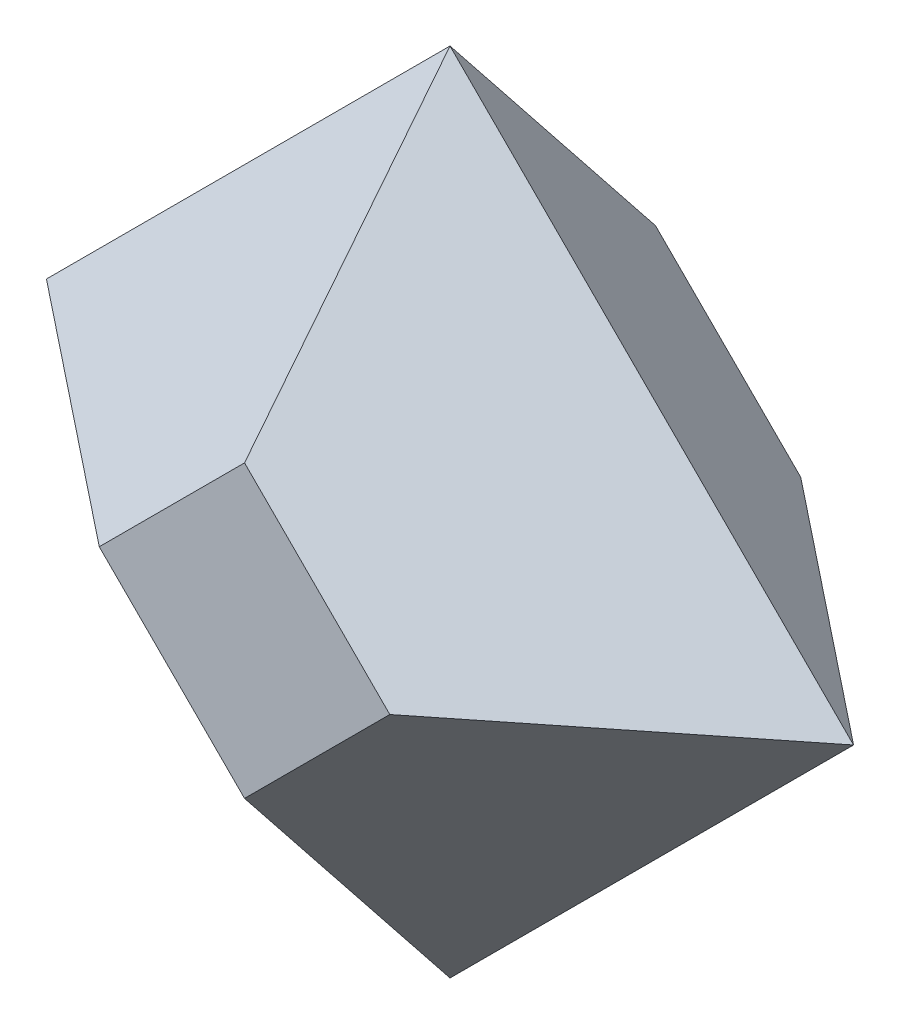
ISO-10303-21;
HEADER;
FILE_DESCRIPTION(('STEP AP214'),'2;1');
FILE_NAME('part.step','',(''),(''),'','','');
FILE_SCHEMA(('AUTOMOTIVE_DESIGN { 1 0 10303 214 1 1 1 1 }'));
ENDSEC;
DATA;
#1=APPLICATION_CONTEXT('core data for automotive mechanical design processes');
#2=APPLICATION_PROTOCOL_DEFINITION('international standard','automotive_design',2000,#1);
#3=PRODUCT_CONTEXT('',#1,'mechanical');
#4=PRODUCT('Part','Part','',(#3));
#5=PRODUCT_RELATED_PRODUCT_CATEGORY('part','',(#4));
#6=PRODUCT_DEFINITION_FORMATION('','',#4);
#7=PRODUCT_DEFINITION_CONTEXT('part definition',#1,'design');
#8=PRODUCT_DEFINITION('design','',#6,#7);
#9=PRODUCT_DEFINITION_SHAPE('','',#8);
#10=(LENGTH_UNIT() NAMED_UNIT(*) SI_UNIT(.MILLI.,.METRE.));
#11=(NAMED_UNIT(*) PLANE_ANGLE_UNIT() SI_UNIT($,.RADIAN.));
#12=(NAMED_UNIT(*) SI_UNIT($,.STERADIAN.) SOLID_ANGLE_UNIT());
#13=UNCERTAINTY_MEASURE_WITH_UNIT(LENGTH_MEASURE(1.E-05),#10,'distance_accuracy_value','');
#14=(GEOMETRIC_REPRESENTATION_CONTEXT(3) GLOBAL_UNCERTAINTY_ASSIGNED_CONTEXT((#13)) GLOBAL_UNIT_ASSIGNED_CONTEXT((#10,
#11,#12)) REPRESENTATION_CONTEXT('',''));
#15=CARTESIAN_POINT('',(0.,0.,0.));
#16=DIRECTION('',(0.,0.,1.));
#17=DIRECTION('',(1.,0.,0.));
#18=AXIS2_PLACEMENT_3D('',#15,#16,#17);
#19=CARTESIAN_POINT('',(0.,0.,9.));
#20=DIRECTION('',(0.,0.,1.));
#21=DIRECTION('',(1.,0.,0.));
#22=AXIS2_PLACEMENT_3D('',#19,#20,#21);
#23=PLANE('',#22);
#24=DIRECTION('',(-0.707106781186548,0.707106781186548,0.));
#25=VECTOR('',#24,1.);
#26=CARTESIAN_POINT('',(6.36396103067893,0.,9.));
#27=LINE('',#26,#25);
#28=CARTESIAN_POINT('',(6.36396103067893,0.,9.));
#29=VERTEX_POINT('',#28);
#30=CARTESIAN_POINT('',(0.,6.36396103067893,9.));
#31=VERTEX_POINT('',#30);
#32=EDGE_CURVE('E143',#29,#31,#27,.T.);
#33=ORIENTED_EDGE('',*,*,#32,.T.);
#34=DIRECTION('',(-0.707106781186547,-0.707106781186548,0.));
#35=VECTOR('',#34,1.);
#36=CARTESIAN_POINT('',(0.,6.36396103067893,9.));
#37=LINE('',#36,#35);
#38=CARTESIAN_POINT('',(-6.36396103067893,0.,9.));
#39=VERTEX_POINT('',#38);
#40=EDGE_CURVE('E141',#31,#39,#37,.T.);
#41=ORIENTED_EDGE('',*,*,#40,.T.);
#42=DIRECTION('',(0.707106781186548,-0.707106781186548,0.));
#43=VECTOR('',#42,1.);
#44=CARTESIAN_POINT('',(-6.36396103067893,0.,9.));
#45=LINE('',#44,#43);
#46=CARTESIAN_POINT('',(0.,-6.36396103067893,9.));
#47=VERTEX_POINT('',#46);
#48=EDGE_CURVE('E60',#39,#47,#45,.T.);
#49=ORIENTED_EDGE('',*,*,#48,.T.);
#50=DIRECTION('',(0.707106781186547,0.707106781186548,0.));
#51=VECTOR('',#50,1.);
#52=CARTESIAN_POINT('',(0.,-6.36396103067893,9.));
#53=LINE('',#52,#51);
#54=EDGE_CURVE('E12',#47,#29,#53,.T.);
#55=ORIENTED_EDGE('',*,*,#54,.T.);
#56=EDGE_LOOP('',(#33,#41,#49,#55));
#57=FACE_BOUND('',#56,.T.);
#58=ADVANCED_FACE('F51',(#57),#23,.T.);
#59=CARTESIAN_POINT('',(-4.93755597207848,-4.93755597207848,6.20689655172414));
#60=DIRECTION('',(0.528498197563233,0.528498197563233,-0.66436383882992));
#61=DIRECTION('',(0.,0.78258558087123,0.622543017479467));
#62=AXIS2_PLACEMENT_3D('',#59,#60,#61);
#63=PLANE('',#62);
#64=DIRECTION('',(0.,0.78258558087123,0.622543017479467));
#65=VECTOR('',#64,1.);
#66=CARTESIAN_POINT('',(0.,-17.6776695296637,0.));
#67=LINE('',#66,#65);
#68=CARTESIAN_POINT('',(0.,-17.6776695296637,0.));
#69=VERTEX_POINT('',#68);
#70=EDGE_CURVE('E75',#69,#47,#67,.T.);
#71=ORIENTED_EDGE('',*,*,#70,.T.);
#72=ORIENTED_EDGE('',*,*,#48,.F.);
#73=DIRECTION('',(0.78258558087123,0.,0.622543017479467));
#74=VECTOR('',#73,1.);
#75=CARTESIAN_POINT('',(-17.6776695296637,0.,0.));
#76=LINE('',#75,#74);
#77=CARTESIAN_POINT('',(-17.6776695296637,0.,0.));
#78=VERTEX_POINT('',#77);
#79=EDGE_CURVE('E146',#78,#39,#76,.T.);
#80=ORIENTED_EDGE('',*,*,#79,.F.);
#81=DIRECTION('',(0.707106781186548,-0.707106781186547,0.));
#82=VECTOR('',#81,1.);
#83=CARTESIAN_POINT('',(-17.6776695296637,0.,0.));
#84=LINE('',#83,#82);
#85=EDGE_CURVE('E118',#78,#69,#84,.T.);
#86=ORIENTED_EDGE('',*,*,#85,.T.);
#87=EDGE_LOOP('',(#71,#72,#80,#86));
#88=FACE_BOUND('',#87,.T.);
#89=ADVANCED_FACE('F199',(#88),#63,.F.);
#90=CARTESIAN_POINT('',(-4.93755597207848,4.93755597207848,6.20689655172414));
#91=DIRECTION('',(0.528498197563233,-0.528498197563233,-0.66436383882992));
#92=DIRECTION('',(-0.78258558087123,0.,-0.622543017479467));
#93=AXIS2_PLACEMENT_3D('',#90,#91,#92);
#94=PLANE('',#93);
#95=ORIENTED_EDGE('',*,*,#79,.T.);
#96=ORIENTED_EDGE('',*,*,#40,.F.);
#97=DIRECTION('',(0.,-0.78258558087123,0.622543017479467));
#98=VECTOR('',#97,1.);
#99=CARTESIAN_POINT('',(0.,17.6776695296637,0.));
#100=LINE('',#99,#98);
#101=CARTESIAN_POINT('',(0.,17.6776695296637,0.));
#102=VERTEX_POINT('',#101);
#103=EDGE_CURVE('E135',#102,#31,#100,.T.);
#104=ORIENTED_EDGE('',*,*,#103,.F.);
#105=DIRECTION('',(-0.707106781186547,-0.707106781186547,0.));
#106=VECTOR('',#105,1.);
#107=CARTESIAN_POINT('',(0.,17.6776695296637,0.));
#108=LINE('',#107,#106);
#109=EDGE_CURVE('E107',#102,#78,#108,.T.);
#110=ORIENTED_EDGE('',*,*,#109,.T.);
#111=EDGE_LOOP('',(#95,#96,#104,#110));
#112=FACE_BOUND('',#111,.T.);
#113=ADVANCED_FACE('F139',(#112),#94,.F.);
#114=CARTESIAN_POINT('',(4.93755597207848,-4.93755597207848,6.20689655172414));
#115=DIRECTION('',(-0.528498197563233,0.528498197563233,-0.66436383882992));
#116=DIRECTION('',(-0.78258558087123,0.,0.622543017479467));
#117=AXIS2_PLACEMENT_3D('',#114,#115,#116);
#118=PLANE('',#117);
#119=DIRECTION('',(-0.78258558087123,0.,0.622543017479467));
#120=VECTOR('',#119,1.);
#121=CARTESIAN_POINT('',(17.6776695296637,0.,0.));
#122=LINE('',#121,#120);
#123=CARTESIAN_POINT('',(17.6776695296637,0.,0.));
#124=VERTEX_POINT('',#123);
#125=EDGE_CURVE('E137',#124,#29,#122,.T.);
#126=ORIENTED_EDGE('',*,*,#125,.T.);
#127=ORIENTED_EDGE('',*,*,#54,.F.);
#128=ORIENTED_EDGE('',*,*,#70,.F.);
#129=DIRECTION('',(0.707106781186547,0.707106781186548,0.));
#130=VECTOR('',#129,1.);
#131=CARTESIAN_POINT('',(0.,-17.6776695296637,0.));
#132=LINE('',#131,#130);
#133=EDGE_CURVE('E301',#69,#124,#132,.T.);
#134=ORIENTED_EDGE('',*,*,#133,.T.);
#135=EDGE_LOOP('',(#126,#127,#128,#134));
#136=FACE_BOUND('',#135,.T.);
#137=ADVANCED_FACE('F163',(#136),#118,.F.);
#138=CARTESIAN_POINT('',(4.93755597207848,4.93755597207848,6.20689655172414));
#139=DIRECTION('',(-0.528498197563233,-0.528498197563233,-0.66436383882992));
#140=DIRECTION('',(-0.782585580871229,0.,0.622543017479467));
#141=AXIS2_PLACEMENT_3D('',#138,#139,#140);
#142=PLANE('',#141);
#143=ORIENTED_EDGE('',*,*,#103,.T.);
#144=ORIENTED_EDGE('',*,*,#32,.F.);
#145=ORIENTED_EDGE('',*,*,#125,.F.);
#146=DIRECTION('',(-0.707106781186547,0.707106781186547,0.));
#147=VECTOR('',#146,1.);
#148=CARTESIAN_POINT('',(17.6776695296637,0.,0.));
#149=LINE('',#148,#147);
#150=EDGE_CURVE('E119',#124,#102,#149,.T.);
#151=ORIENTED_EDGE('',*,*,#150,.T.);
#152=EDGE_LOOP('',(#143,#144,#145,#151));
#153=FACE_BOUND('',#152,.T.);
#154=ADVANCED_FACE('F134',(#153),#142,.F.);
#155=CARTESIAN_POINT('',(0.,0.,-9.));
#156=DIRECTION('',(0.,0.,-1.));
#157=DIRECTION('',(-1.,0.,0.));
#158=AXIS2_PLACEMENT_3D('',#155,#156,#157);
#159=PLANE('',#158);
#160=DIRECTION('',(-0.707106781186548,-0.707106781186548,0.));
#161=VECTOR('',#160,1.);
#162=CARTESIAN_POINT('',(6.36396103067887,0.,-9.00000000000004));
#163=LINE('',#162,#161);
#164=CARTESIAN_POINT('',(6.36396103067887,0.,-9.00000000000004));
#165=VERTEX_POINT('',#164);
#166=CARTESIAN_POINT('',(0.,-6.36396103067893,-9.));
#167=VERTEX_POINT('',#166);
#168=EDGE_CURVE('E129',#165,#167,#163,.T.);
#169=ORIENTED_EDGE('',*,*,#168,.T.);
#170=DIRECTION('',(-0.707106781186547,0.707106781186548,0.));
#171=VECTOR('',#170,1.);
#172=CARTESIAN_POINT('',(0.,-6.36396103067893,-9.));
#173=LINE('',#172,#171);
#174=CARTESIAN_POINT('',(-6.36396103067898,0.,-8.99999999999995));
#175=VERTEX_POINT('',#174);
#176=EDGE_CURVE('E236',#167,#175,#173,.T.);
#177=ORIENTED_EDGE('',*,*,#176,.T.);
#178=DIRECTION('',(0.707106781186548,0.707106781186548,0.));
#179=VECTOR('',#178,1.);
#180=CARTESIAN_POINT('',(-6.36396103067898,0.,-8.99999999999995));
#181=LINE('',#180,#179);
#182=CARTESIAN_POINT('',(0.,6.36396103067893,-9.));
#183=VERTEX_POINT('',#182);
#184=EDGE_CURVE('E243',#175,#183,#181,.T.);
#185=ORIENTED_EDGE('',*,*,#184,.T.);
#186=DIRECTION('',(0.707106781186547,-0.707106781186547,0.));
#187=VECTOR('',#186,1.);
#188=CARTESIAN_POINT('',(0.,6.36396103067893,-9.));
#189=LINE('',#188,#187);
#190=EDGE_CURVE('E126',#183,#165,#189,.T.);
#191=ORIENTED_EDGE('',*,*,#190,.T.);
#192=EDGE_LOOP('',(#169,#177,#185,#191));
#193=FACE_BOUND('',#192,.T.);
#194=ADVANCED_FACE('F176',(#193),#159,.T.);
#195=CARTESIAN_POINT('',(4.93755597207849,-4.93755597207847,-6.20689655172416));
#196=DIRECTION('',(-0.528498197563234,0.528498197563231,0.664363838829921));
#197=DIRECTION('',(0.78258558087123,0.,0.622543017479467));
#198=AXIS2_PLACEMENT_3D('',#195,#196,#197);
#199=PLANE('',#198);
#200=DIRECTION('',(0.,0.78258558087123,-0.622543017479467));
#201=VECTOR('',#200,1.);
#202=CARTESIAN_POINT('',(0.,-17.6776695296637,0.));
#203=LINE('',#202,#201);
#204=EDGE_CURVE('E258',#69,#167,#203,.T.);
#205=ORIENTED_EDGE('',*,*,#204,.T.);
#206=ORIENTED_EDGE('',*,*,#168,.F.);
#207=DIRECTION('',(-0.78258558087123,0.,-0.622543017479467));
#208=VECTOR('',#207,1.);
#209=CARTESIAN_POINT('',(17.6776695296637,0.,0.));
#210=LINE('',#209,#208);
#211=EDGE_CURVE('E256',#124,#165,#210,.T.);
#212=ORIENTED_EDGE('',*,*,#211,.F.);
#213=ORIENTED_EDGE('',*,*,#133,.F.);
#214=EDGE_LOOP('',(#205,#206,#212,#213));
#215=FACE_BOUND('',#214,.T.);
#216=ADVANCED_FACE('F211',(#215),#199,.F.);
#217=CARTESIAN_POINT('',(4.93755597207847,4.93755597207844,-6.20689655172412));
#218=DIRECTION('',(-0.528498197563234,-0.528498197563231,0.664363838829921));
#219=DIRECTION('',(0.782585580871229,0.,0.622543017479467));
#220=AXIS2_PLACEMENT_3D('',#217,#218,#219);
#221=PLANE('',#220);
#222=ORIENTED_EDGE('',*,*,#211,.T.);
#223=ORIENTED_EDGE('',*,*,#190,.F.);
#224=DIRECTION('',(0.,-0.78258558087123,-0.622543017479467));
#225=VECTOR('',#224,1.);
#226=CARTESIAN_POINT('',(0.,17.6776695296637,0.));
#227=LINE('',#226,#225);
#228=EDGE_CURVE('E110',#102,#183,#227,.T.);
#229=ORIENTED_EDGE('',*,*,#228,.F.);
#230=ORIENTED_EDGE('',*,*,#150,.F.);
#231=EDGE_LOOP('',(#222,#223,#229,#230));
#232=FACE_BOUND('',#231,.T.);
#233=ADVANCED_FACE('F124',(#232),#221,.F.);
#234=CARTESIAN_POINT('',(-4.93755597207849,-4.93755597207851,-6.20689655172415));
#235=DIRECTION('',(0.528498197563232,0.528498197563235,0.664363838829919));
#236=DIRECTION('',(0.,-0.782585580871228,0.622543017479469));
#237=AXIS2_PLACEMENT_3D('',#234,#235,#236);
#238=PLANE('',#237);
#239=DIRECTION('',(0.78258558087123,0.,-0.622543017479467));
#240=VECTOR('',#239,1.);
#241=CARTESIAN_POINT('',(-17.6776695296637,0.,0.));
#242=LINE('',#241,#240);
#243=EDGE_CURVE('E113',#78,#175,#242,.T.);
#244=ORIENTED_EDGE('',*,*,#243,.T.);
#245=ORIENTED_EDGE('',*,*,#176,.F.);
#246=ORIENTED_EDGE('',*,*,#204,.F.);
#247=ORIENTED_EDGE('',*,*,#85,.F.);
#248=EDGE_LOOP('',(#244,#245,#246,#247));
#249=FACE_BOUND('',#248,.T.);
#250=ADVANCED_FACE('F279',(#249),#238,.F.);
#251=CARTESIAN_POINT('',(-4.93755597207846,4.93755597207849,-6.20689655172412));
#252=DIRECTION('',(0.528498197563232,-0.528498197563235,0.664363838829919));
#253=DIRECTION('',(0.,-0.782585580871228,-0.622543017479469));
#254=AXIS2_PLACEMENT_3D('',#251,#252,#253);
#255=PLANE('',#254);
#256=ORIENTED_EDGE('',*,*,#228,.T.);
#257=ORIENTED_EDGE('',*,*,#184,.F.);
#258=ORIENTED_EDGE('',*,*,#243,.F.);
#259=ORIENTED_EDGE('',*,*,#109,.F.);
#260=EDGE_LOOP('',(#256,#257,#258,#259));
#261=FACE_BOUND('',#260,.T.);
#262=ADVANCED_FACE('F109',(#261),#255,.F.);
#263=CLOSED_SHELL('',(#58,#89,#113,#137,#154,#194,#216,#233,#250,#262));
#264=MANIFOLD_SOLID_BREP('B2',#263);
#265=ADVANCED_BREP_SHAPE_REPRESENTATION('',(#18,#264),#14);
#266=SHAPE_DEFINITION_REPRESENTATION(#9,#265);
ENDSEC;
END-ISO-10303-21;
